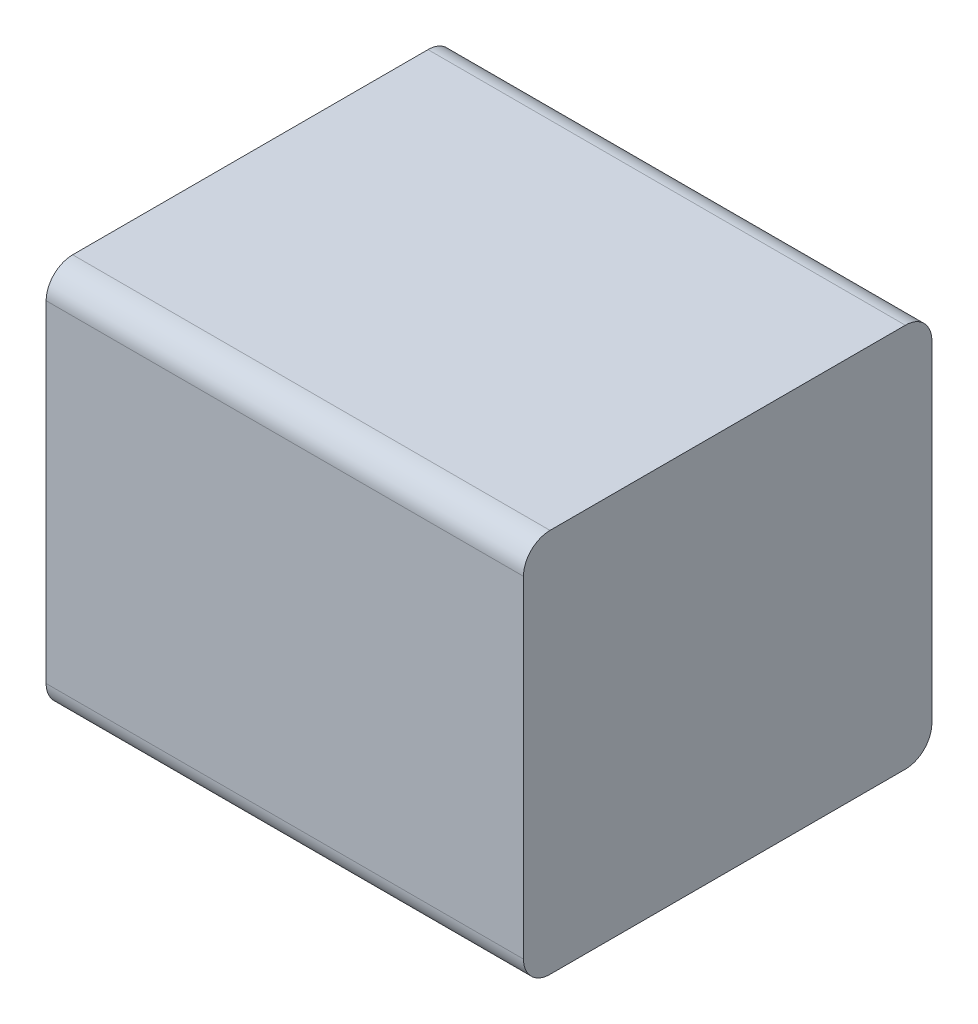
ISO-10303-21;
HEADER;
FILE_DESCRIPTION(('STEP AP214'),'2;1');
FILE_NAME('part.step','',(''),(''),'','','');
FILE_SCHEMA(('AUTOMOTIVE_DESIGN { 1 0 10303 214 1 1 1 1 }'));
ENDSEC;
DATA;
#1=APPLICATION_CONTEXT('core data for automotive mechanical design processes');
#2=APPLICATION_PROTOCOL_DEFINITION('international standard','automotive_design',2000,#1);
#3=PRODUCT_CONTEXT('',#1,'mechanical');
#4=PRODUCT('Part','Part','',(#3));
#5=PRODUCT_RELATED_PRODUCT_CATEGORY('part','',(#4));
#6=PRODUCT_DEFINITION_FORMATION('','',#4);
#7=PRODUCT_DEFINITION_CONTEXT('part definition',#1,'design');
#8=PRODUCT_DEFINITION('design','',#6,#7);
#9=PRODUCT_DEFINITION_SHAPE('','',#8);
#10=(LENGTH_UNIT() NAMED_UNIT(*) SI_UNIT(.MILLI.,.METRE.));
#11=(NAMED_UNIT(*) PLANE_ANGLE_UNIT() SI_UNIT($,.RADIAN.));
#12=(NAMED_UNIT(*) SI_UNIT($,.STERADIAN.) SOLID_ANGLE_UNIT());
#13=UNCERTAINTY_MEASURE_WITH_UNIT(LENGTH_MEASURE(1.E-05),#10,'distance_accuracy_value','');
#14=(GEOMETRIC_REPRESENTATION_CONTEXT(3) GLOBAL_UNCERTAINTY_ASSIGNED_CONTEXT((#13)) GLOBAL_UNIT_ASSIGNED_CONTEXT((#10,
#11,#12)) REPRESENTATION_CONTEXT('',''));
#15=CARTESIAN_POINT('',(0.,0.,0.));
#16=DIRECTION('',(0.,0.,1.));
#17=DIRECTION('',(1.,0.,0.));
#18=AXIS2_PLACEMENT_3D('',#15,#16,#17);
#19=CARTESIAN_POINT('',(-0.45,-0.35,0.05));
#20=DIRECTION('',(1.,0.,0.));
#21=DIRECTION('',(0.,1.,0.));
#22=AXIS2_PLACEMENT_3D('',#19,#20,#21);
#23=PLANE('',#22);
#24=CARTESIAN_POINT('',(-0.45,-0.3,0.77));
#25=DIRECTION('',(-1.,0.,0.));
#26=DIRECTION('',(0.,0.,1.));
#27=AXIS2_PLACEMENT_3D('',#24,#25,#26);
#28=CIRCLE('',#27,0.05);
#29=CARTESIAN_POINT('',(-0.45,-0.35,0.77));
#30=VERTEX_POINT('',#29);
#31=CARTESIAN_POINT('',(-0.45,-0.3,0.82));
#32=VERTEX_POINT('',#31);
#33=EDGE_CURVE('E11',#30,#32,#28,.T.);
#34=ORIENTED_EDGE('',*,*,#33,.T.);
#35=DIRECTION('',(0.,1.,0.));
#36=VECTOR('',#35,1.);
#37=CARTESIAN_POINT('',(-0.45,-0.35,0.82));
#38=LINE('',#37,#36);
#39=CARTESIAN_POINT('',(-0.45,0.325,0.82));
#40=VERTEX_POINT('',#39);
#41=EDGE_CURVE('E27',#32,#40,#38,.T.);
#42=ORIENTED_EDGE('',*,*,#41,.T.);
#43=CARTESIAN_POINT('',(-0.45,0.325,0.77));
#44=DIRECTION('',(1.,0.,0.));
#45=DIRECTION('',(0.,0.,1.));
#46=AXIS2_PLACEMENT_3D('',#43,#44,#45);
#47=CIRCLE('',#46,0.05);
#48=CARTESIAN_POINT('',(-0.45,0.375,0.77));
#49=VERTEX_POINT('',#48);
#50=EDGE_CURVE('E147',#49,#40,#47,.T.);
#51=ORIENTED_EDGE('',*,*,#50,.F.);
#52=DIRECTION('',(0.,0.,1.));
#53=VECTOR('',#52,1.);
#54=CARTESIAN_POINT('',(-0.45,0.375,0.05));
#55=LINE('',#54,#53);
#56=CARTESIAN_POINT('',(-0.45,0.375,0.1));
#57=VERTEX_POINT('',#56);
#58=EDGE_CURVE('E121',#57,#49,#55,.T.);
#59=ORIENTED_EDGE('',*,*,#58,.F.);
#60=CARTESIAN_POINT('',(-0.45,0.325,0.1));
#61=DIRECTION('',(-1.,0.,0.));
#62=DIRECTION('',(0.,0.,1.));
#63=AXIS2_PLACEMENT_3D('',#60,#61,#62);
#64=CIRCLE('',#63,0.05);
#65=CARTESIAN_POINT('',(-0.45,0.325,0.05));
#66=VERTEX_POINT('',#65);
#67=EDGE_CURVE('E86',#57,#66,#64,.T.);
#68=ORIENTED_EDGE('',*,*,#67,.T.);
#69=DIRECTION('',(0.,1.,0.));
#70=VECTOR('',#69,1.);
#71=CARTESIAN_POINT('',(-0.45,-0.35,0.05));
#72=LINE('',#71,#70);
#73=CARTESIAN_POINT('',(-0.45,-0.3,0.05));
#74=VERTEX_POINT('',#73);
#75=EDGE_CURVE('E75',#74,#66,#72,.T.);
#76=ORIENTED_EDGE('',*,*,#75,.F.);
#77=CARTESIAN_POINT('',(-0.45,-0.3,0.1));
#78=DIRECTION('',(1.,0.,0.));
#79=DIRECTION('',(0.,0.,1.));
#80=AXIS2_PLACEMENT_3D('',#77,#78,#79);
#81=CIRCLE('',#80,0.05);
#82=CARTESIAN_POINT('',(-0.45,-0.35,0.1));
#83=VERTEX_POINT('',#82);
#84=EDGE_CURVE('E83',#83,#74,#81,.T.);
#85=ORIENTED_EDGE('',*,*,#84,.F.);
#86=DIRECTION('',(0.,0.,1.));
#87=VECTOR('',#86,1.);
#88=CARTESIAN_POINT('',(-0.45,-0.35,0.05));
#89=LINE('',#88,#87);
#90=EDGE_CURVE('E130',#83,#30,#89,.T.);
#91=ORIENTED_EDGE('',*,*,#90,.T.);
#92=EDGE_LOOP('',(#34,#42,#51,#59,#68,#76,#85,#91));
#93=FACE_BOUND('',#92,.T.);
#94=ADVANCED_FACE('F16',(#93),#23,.F.);
#95=CARTESIAN_POINT('',(-0.45,-0.35,0.05));
#96=DIRECTION('',(0.,1.,0.));
#97=DIRECTION('',(1.,0.,0.));
#98=AXIS2_PLACEMENT_3D('',#95,#96,#97);
#99=PLANE('',#98);
#100=DIRECTION('',(1.,0.,0.));
#101=VECTOR('',#100,1.);
#102=CARTESIAN_POINT('',(-0.45,-0.35,0.77));
#103=LINE('',#102,#101);
#104=CARTESIAN_POINT('',(0.45,-0.35,0.77));
#105=VERTEX_POINT('',#104);
#106=EDGE_CURVE('E108',#30,#105,#103,.T.);
#107=ORIENTED_EDGE('',*,*,#106,.F.);
#108=ORIENTED_EDGE('',*,*,#90,.F.);
#109=DIRECTION('',(1.,0.,0.));
#110=VECTOR('',#109,1.);
#111=CARTESIAN_POINT('',(-0.45,-0.35,0.1));
#112=LINE('',#111,#110);
#113=CARTESIAN_POINT('',(0.45,-0.35,0.1));
#114=VERTEX_POINT('',#113);
#115=EDGE_CURVE('E100',#83,#114,#112,.T.);
#116=ORIENTED_EDGE('',*,*,#115,.T.);
#117=DIRECTION('',(0.,0.,1.));
#118=VECTOR('',#117,1.);
#119=CARTESIAN_POINT('',(0.45,-0.35,0.05));
#120=LINE('',#119,#118);
#121=EDGE_CURVE('E102',#114,#105,#120,.T.);
#122=ORIENTED_EDGE('',*,*,#121,.T.);
#123=EDGE_LOOP('',(#107,#108,#116,#122));
#124=FACE_BOUND('',#123,.T.);
#125=ADVANCED_FACE('F213',(#124),#99,.F.);
#126=CARTESIAN_POINT('',(-0.45,-0.3,0.1));
#127=DIRECTION('',(1.,0.,0.));
#128=DIRECTION('',(0.,-1.,0.));
#129=AXIS2_PLACEMENT_3D('',#126,#127,#128);
#130=CYLINDRICAL_SURFACE('',#129,0.05);
#131=ORIENTED_EDGE('',*,*,#84,.T.);
#132=DIRECTION('',(1.,0.,0.));
#133=VECTOR('',#132,1.);
#134=CARTESIAN_POINT('',(-0.45,-0.3,0.05));
#135=LINE('',#134,#133);
#136=CARTESIAN_POINT('',(0.45,-0.3,0.05));
#137=VERTEX_POINT('',#136);
#138=EDGE_CURVE('E97',#74,#137,#135,.T.);
#139=ORIENTED_EDGE('',*,*,#138,.T.);
#140=CARTESIAN_POINT('',(0.45,-0.3,0.1));
#141=DIRECTION('',(1.,0.,0.));
#142=DIRECTION('',(0.,0.,1.));
#143=AXIS2_PLACEMENT_3D('',#140,#141,#142);
#144=CIRCLE('',#143,0.05);
#145=EDGE_CURVE('E20',#114,#137,#144,.T.);
#146=ORIENTED_EDGE('',*,*,#145,.F.);
#147=ORIENTED_EDGE('',*,*,#115,.F.);
#148=EDGE_LOOP('',(#131,#139,#146,#147));
#149=FACE_BOUND('',#148,.T.);
#150=ADVANCED_FACE('F95',(#149),#130,.T.);
#151=CARTESIAN_POINT('',(-0.45,-0.3,0.77));
#152=DIRECTION('',(1.,0.,0.));
#153=DIRECTION('',(0.,-1.,0.));
#154=AXIS2_PLACEMENT_3D('',#151,#152,#153);
#155=CYLINDRICAL_SURFACE('',#154,0.05);
#156=ORIENTED_EDGE('',*,*,#106,.T.);
#157=CARTESIAN_POINT('',(0.45,-0.3,0.77));
#158=DIRECTION('',(-1.,0.,0.));
#159=DIRECTION('',(0.,0.,1.));
#160=AXIS2_PLACEMENT_3D('',#157,#158,#159);
#161=CIRCLE('',#160,0.05);
#162=CARTESIAN_POINT('',(0.45,-0.3,0.82));
#163=VERTEX_POINT('',#162);
#164=EDGE_CURVE('E114',#105,#163,#161,.T.);
#165=ORIENTED_EDGE('',*,*,#164,.T.);
#166=DIRECTION('',(1.,0.,0.));
#167=VECTOR('',#166,1.);
#168=CARTESIAN_POINT('',(-0.45,-0.3,0.82));
#169=LINE('',#168,#167);
#170=EDGE_CURVE('E90',#32,#163,#169,.T.);
#171=ORIENTED_EDGE('',*,*,#170,.F.);
#172=ORIENTED_EDGE('',*,*,#33,.F.);
#173=EDGE_LOOP('',(#156,#165,#171,#172));
#174=FACE_BOUND('',#173,.T.);
#175=ADVANCED_FACE('F187',(#174),#155,.T.);
#176=CARTESIAN_POINT('',(-0.45,-0.35,0.05));
#177=DIRECTION('',(0.,0.,1.));
#178=DIRECTION('',(1.,0.,0.));
#179=AXIS2_PLACEMENT_3D('',#176,#177,#178);
#180=PLANE('',#179);
#181=DIRECTION('',(1.,0.,0.));
#182=VECTOR('',#181,1.);
#183=CARTESIAN_POINT('',(-0.45,0.325,0.05));
#184=LINE('',#183,#182);
#185=CARTESIAN_POINT('',(0.45,0.325,0.05));
#186=VERTEX_POINT('',#185);
#187=EDGE_CURVE('E89',#66,#186,#184,.T.);
#188=ORIENTED_EDGE('',*,*,#187,.T.);
#189=DIRECTION('',(0.,1.,0.));
#190=VECTOR('',#189,1.);
#191=CARTESIAN_POINT('',(0.45,-0.35,0.05));
#192=LINE('',#191,#190);
#193=EDGE_CURVE('E106',#137,#186,#192,.T.);
#194=ORIENTED_EDGE('',*,*,#193,.F.);
#195=ORIENTED_EDGE('',*,*,#138,.F.);
#196=ORIENTED_EDGE('',*,*,#75,.T.);
#197=EDGE_LOOP('',(#188,#194,#195,#196));
#198=FACE_BOUND('',#197,.T.);
#199=ADVANCED_FACE('F104',(#198),#180,.F.);
#200=CARTESIAN_POINT('',(-0.45,-0.35,0.82));
#201=DIRECTION('',(0.,0.,1.));
#202=DIRECTION('',(1.,0.,0.));
#203=AXIS2_PLACEMENT_3D('',#200,#201,#202);
#204=PLANE('',#203);
#205=ORIENTED_EDGE('',*,*,#41,.F.);
#206=ORIENTED_EDGE('',*,*,#170,.T.);
#207=DIRECTION('',(0.,1.,0.));
#208=VECTOR('',#207,1.);
#209=CARTESIAN_POINT('',(0.45,-0.35,0.82));
#210=LINE('',#209,#208);
#211=CARTESIAN_POINT('',(0.45,0.325,0.82));
#212=VERTEX_POINT('',#211);
#213=EDGE_CURVE('E135',#163,#212,#210,.T.);
#214=ORIENTED_EDGE('',*,*,#213,.T.);
#215=DIRECTION('',(1.,0.,0.));
#216=VECTOR('',#215,1.);
#217=CARTESIAN_POINT('',(-0.45,0.325,0.82));
#218=LINE('',#217,#216);
#219=EDGE_CURVE('E124',#40,#212,#218,.T.);
#220=ORIENTED_EDGE('',*,*,#219,.F.);
#221=EDGE_LOOP('',(#205,#206,#214,#220));
#222=FACE_BOUND('',#221,.T.);
#223=ADVANCED_FACE('F195',(#222),#204,.T.);
#224=CARTESIAN_POINT('',(-0.45,0.325,0.1));
#225=DIRECTION('',(1.,0.,0.));
#226=DIRECTION('',(0.,1.,0.));
#227=AXIS2_PLACEMENT_3D('',#224,#225,#226);
#228=CYLINDRICAL_SURFACE('',#227,0.05);
#229=DIRECTION('',(1.,0.,0.));
#230=VECTOR('',#229,1.);
#231=CARTESIAN_POINT('',(-0.45,0.375,0.1));
#232=LINE('',#231,#230);
#233=CARTESIAN_POINT('',(0.45,0.375,0.1));
#234=VERTEX_POINT('',#233);
#235=EDGE_CURVE('E139',#57,#234,#232,.T.);
#236=ORIENTED_EDGE('',*,*,#235,.T.);
#237=CARTESIAN_POINT('',(0.45,0.325,0.1));
#238=DIRECTION('',(-1.,0.,0.));
#239=DIRECTION('',(0.,0.,1.));
#240=AXIS2_PLACEMENT_3D('',#237,#238,#239);
#241=CIRCLE('',#240,0.05);
#242=EDGE_CURVE('E142',#234,#186,#241,.T.);
#243=ORIENTED_EDGE('',*,*,#242,.T.);
#244=ORIENTED_EDGE('',*,*,#187,.F.);
#245=ORIENTED_EDGE('',*,*,#67,.F.);
#246=EDGE_LOOP('',(#236,#243,#244,#245));
#247=FACE_BOUND('',#246,.T.);
#248=ADVANCED_FACE('F18',(#247),#228,.T.);
#249=CARTESIAN_POINT('',(-0.45,0.325,0.77));
#250=DIRECTION('',(1.,0.,0.));
#251=DIRECTION('',(0.,1.,0.));
#252=AXIS2_PLACEMENT_3D('',#249,#250,#251);
#253=CYLINDRICAL_SURFACE('',#252,0.05);
#254=ORIENTED_EDGE('',*,*,#50,.T.);
#255=ORIENTED_EDGE('',*,*,#219,.T.);
#256=CARTESIAN_POINT('',(0.45,0.325,0.77));
#257=DIRECTION('',(1.,0.,0.));
#258=DIRECTION('',(0.,0.,1.));
#259=AXIS2_PLACEMENT_3D('',#256,#257,#258);
#260=CIRCLE('',#259,0.05);
#261=CARTESIAN_POINT('',(0.45,0.375,0.77));
#262=VERTEX_POINT('',#261);
#263=EDGE_CURVE('E153',#262,#212,#260,.T.);
#264=ORIENTED_EDGE('',*,*,#263,.F.);
#265=DIRECTION('',(1.,0.,0.));
#266=VECTOR('',#265,1.);
#267=CARTESIAN_POINT('',(-0.45,0.375,0.77));
#268=LINE('',#267,#266);
#269=EDGE_CURVE('E125',#49,#262,#268,.T.);
#270=ORIENTED_EDGE('',*,*,#269,.F.);
#271=EDGE_LOOP('',(#254,#255,#264,#270));
#272=FACE_BOUND('',#271,.T.);
#273=ADVANCED_FACE('F261',(#272),#253,.T.);
#274=CARTESIAN_POINT('',(-0.45,0.375,0.05));
#275=DIRECTION('',(0.,1.,0.));
#276=DIRECTION('',(1.,0.,0.));
#277=AXIS2_PLACEMENT_3D('',#274,#275,#276);
#278=PLANE('',#277);
#279=DIRECTION('',(0.,0.,1.));
#280=VECTOR('',#279,1.);
#281=CARTESIAN_POINT('',(0.45,0.375,0.05));
#282=LINE('',#281,#280);
#283=EDGE_CURVE('E156',#234,#262,#282,.T.);
#284=ORIENTED_EDGE('',*,*,#283,.F.);
#285=ORIENTED_EDGE('',*,*,#235,.F.);
#286=ORIENTED_EDGE('',*,*,#58,.T.);
#287=ORIENTED_EDGE('',*,*,#269,.T.);
#288=EDGE_LOOP('',(#284,#285,#286,#287));
#289=FACE_BOUND('',#288,.T.);
#290=ADVANCED_FACE('F266',(#289),#278,.T.);
#291=CARTESIAN_POINT('',(0.45,-0.35,0.05));
#292=DIRECTION('',(1.,0.,0.));
#293=DIRECTION('',(0.,1.,0.));
#294=AXIS2_PLACEMENT_3D('',#291,#292,#293);
#295=PLANE('',#294);
#296=ORIENTED_EDGE('',*,*,#121,.F.);
#297=ORIENTED_EDGE('',*,*,#145,.T.);
#298=ORIENTED_EDGE('',*,*,#193,.T.);
#299=ORIENTED_EDGE('',*,*,#242,.F.);
#300=ORIENTED_EDGE('',*,*,#283,.T.);
#301=ORIENTED_EDGE('',*,*,#263,.T.);
#302=ORIENTED_EDGE('',*,*,#213,.F.);
#303=ORIENTED_EDGE('',*,*,#164,.F.);
#304=EDGE_LOOP('',(#296,#297,#298,#299,#300,#301,#302,#303));
#305=FACE_BOUND('',#304,.T.);
#306=ADVANCED_FACE('F192',(#305),#295,.T.);
#307=CLOSED_SHELL('',(#94,#125,#150,#175,#199,#223,#248,#273,#290,#306));
#308=MANIFOLD_SOLID_BREP('B1',#307);
#309=ADVANCED_BREP_SHAPE_REPRESENTATION('',(#18,#308),#14);
#310=SHAPE_DEFINITION_REPRESENTATION(#9,#309);
ENDSEC;
END-ISO-10303-21;
